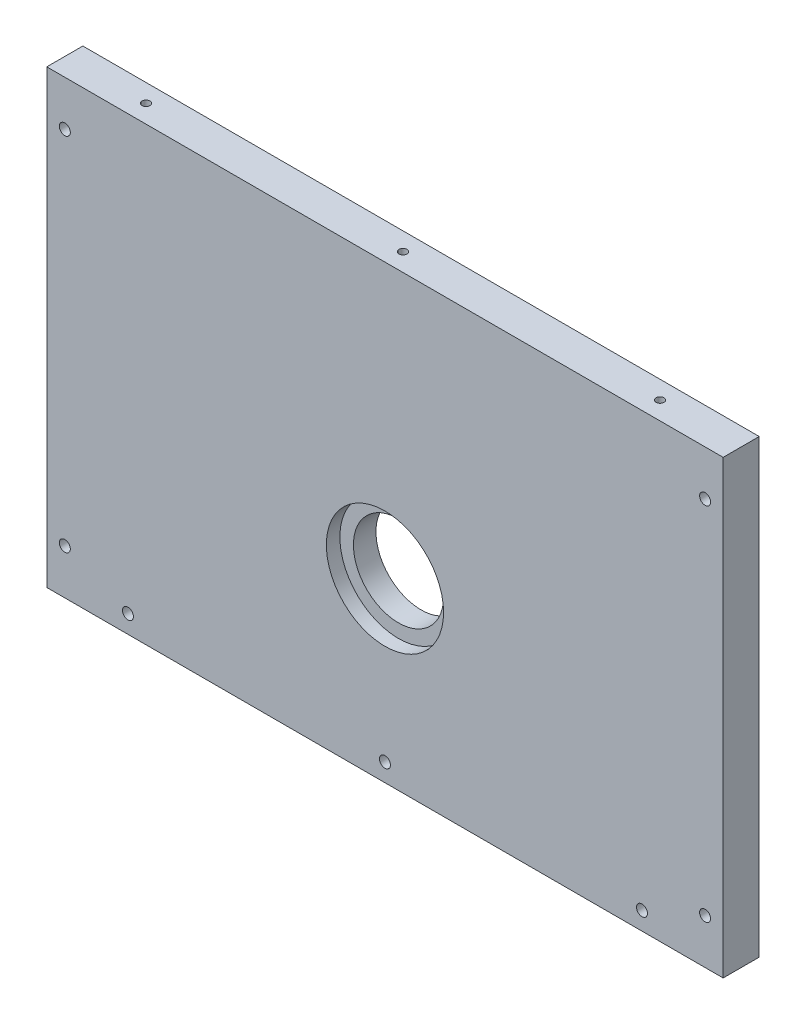
ISO-10303-21;
HEADER;
FILE_DESCRIPTION(('STEP AP214'),'2;1');
FILE_NAME('part.step','',(''),(''),'','','');
FILE_SCHEMA(('AUTOMOTIVE_DESIGN { 1 0 10303 214 1 1 1 1 }'));
ENDSEC;
DATA;
#1=APPLICATION_CONTEXT('core data for automotive mechanical design processes');
#2=APPLICATION_PROTOCOL_DEFINITION('international standard','automotive_design',2000,#1);
#3=PRODUCT_CONTEXT('',#1,'mechanical');
#4=PRODUCT('Part','Part','',(#3));
#5=PRODUCT_RELATED_PRODUCT_CATEGORY('part','',(#4));
#6=PRODUCT_DEFINITION_FORMATION('','',#4);
#7=PRODUCT_DEFINITION_CONTEXT('part definition',#1,'design');
#8=PRODUCT_DEFINITION('design','',#6,#7);
#9=PRODUCT_DEFINITION_SHAPE('','',#8);
#10=(LENGTH_UNIT() NAMED_UNIT(*) SI_UNIT(.MILLI.,.METRE.));
#11=(NAMED_UNIT(*) PLANE_ANGLE_UNIT() SI_UNIT($,.RADIAN.));
#12=(NAMED_UNIT(*) SI_UNIT($,.STERADIAN.) SOLID_ANGLE_UNIT());
#13=UNCERTAINTY_MEASURE_WITH_UNIT(LENGTH_MEASURE(1.E-05),#10,'distance_accuracy_value','');
#14=(GEOMETRIC_REPRESENTATION_CONTEXT(3) GLOBAL_UNCERTAINTY_ASSIGNED_CONTEXT((#13)) GLOBAL_UNIT_ASSIGNED_CONTEXT((#10,
#11,#12)) REPRESENTATION_CONTEXT('',''));
#15=CARTESIAN_POINT('',(0.,0.,0.));
#16=DIRECTION('',(0.,0.,1.));
#17=DIRECTION('',(1.,0.,0.));
#18=AXIS2_PLACEMENT_3D('',#15,#16,#17);
#19=CARTESIAN_POINT('',(75.,39.2,0.));
#20=DIRECTION('',(0.,0.,1.));
#21=DIRECTION('',(1.,0.,0.));
#22=AXIS2_PLACEMENT_3D('',#19,#20,#21);
#23=CYLINDRICAL_SURFACE('',#22,10.);
#24=CARTESIAN_POINT('',(75.,39.2,0.));
#25=DIRECTION('',(0.,0.,1.));
#26=DIRECTION('',(1.,0.,0.));
#27=AXIS2_PLACEMENT_3D('',#24,#25,#26);
#28=CIRCLE('',#27,10.);
#29=CARTESIAN_POINT('',(85.,39.2,0.));
#30=VERTEX_POINT('',#29);
#31=EDGE_CURVE('E131',#30,#30,#28,.T.);
#32=ORIENTED_EDGE('',*,*,#31,.F.);
#33=EDGE_LOOP('',(#32));
#34=FACE_BOUND('',#33,.T.);
#35=CARTESIAN_POINT('',(75.,39.2,5.));
#36=DIRECTION('',(0.,0.,1.));
#37=DIRECTION('',(1.,0.,0.));
#38=AXIS2_PLACEMENT_3D('',#35,#36,#37);
#39=CIRCLE('',#38,10.);
#40=CARTESIAN_POINT('',(85.,39.2,5.));
#41=VERTEX_POINT('',#40);
#42=EDGE_CURVE('E43',#41,#41,#39,.F.);
#43=ORIENTED_EDGE('',*,*,#42,.F.);
#44=EDGE_LOOP('',(#43));
#45=FACE_BOUND('',#44,.T.);
#46=ADVANCED_FACE('F39',(#34,#45),#23,.F.);
#47=CARTESIAN_POINT('',(0.,0.,8.));
#48=DIRECTION('',(1.,0.,0.));
#49=DIRECTION('',(0.,0.,-1.));
#50=AXIS2_PLACEMENT_3D('',#47,#48,#49);
#51=PLANE('',#50);
#52=DIRECTION('',(0.,-1.,0.));
#53=VECTOR('',#52,1.);
#54=CARTESIAN_POINT('',(0.,0.,0.));
#55=LINE('',#54,#53);
#56=CARTESIAN_POINT('',(0.,100.,0.));
#57=VERTEX_POINT('',#56);
#58=CARTESIAN_POINT('',(0.,0.,0.));
#59=VERTEX_POINT('',#58);
#60=EDGE_CURVE('E218',#57,#59,#55,.T.);
#61=ORIENTED_EDGE('',*,*,#60,.T.);
#62=DIRECTION('',(0.,0.,-1.));
#63=VECTOR('',#62,1.);
#64=CARTESIAN_POINT('',(0.,0.,8.));
#65=LINE('',#64,#63);
#66=CARTESIAN_POINT('',(0.,0.,8.));
#67=VERTEX_POINT('',#66);
#68=EDGE_CURVE('E11',#67,#59,#65,.T.);
#69=ORIENTED_EDGE('',*,*,#68,.F.);
#70=DIRECTION('',(0.,-1.,0.));
#71=VECTOR('',#70,1.);
#72=CARTESIAN_POINT('',(0.,0.,8.));
#73=LINE('',#72,#71);
#74=CARTESIAN_POINT('',(0.,100.,8.));
#75=VERTEX_POINT('',#74);
#76=EDGE_CURVE('E219',#75,#67,#73,.T.);
#77=ORIENTED_EDGE('',*,*,#76,.F.);
#78=DIRECTION('',(0.,0.,-1.));
#79=VECTOR('',#78,1.);
#80=CARTESIAN_POINT('',(0.,100.,8.));
#81=LINE('',#80,#79);
#82=EDGE_CURVE('E225',#75,#57,#81,.T.);
#83=ORIENTED_EDGE('',*,*,#82,.T.);
#84=EDGE_LOOP('',(#61,#69,#77,#83));
#85=FACE_BOUND('',#84,.T.);
#86=ADVANCED_FACE('F41',(#85),#51,.F.);
#87=CARTESIAN_POINT('',(0.,0.,8.));
#88=DIRECTION('',(0.,1.,0.));
#89=DIRECTION('',(0.,0.,1.));
#90=AXIS2_PLACEMENT_3D('',#87,#88,#89);
#91=PLANE('',#90);
#92=DIRECTION('',(1.,0.,0.));
#93=VECTOR('',#92,1.);
#94=CARTESIAN_POINT('',(0.,0.,0.));
#95=LINE('',#94,#93);
#96=CARTESIAN_POINT('',(150.,0.,0.));
#97=VERTEX_POINT('',#96);
#98=EDGE_CURVE('E228',#59,#97,#95,.T.);
#99=ORIENTED_EDGE('',*,*,#98,.T.);
#100=DIRECTION('',(0.,0.,-1.));
#101=VECTOR('',#100,1.);
#102=CARTESIAN_POINT('',(150.,0.,8.));
#103=LINE('',#102,#101);
#104=CARTESIAN_POINT('',(150.,0.,8.));
#105=VERTEX_POINT('',#104);
#106=EDGE_CURVE('E49',#105,#97,#103,.T.);
#107=ORIENTED_EDGE('',*,*,#106,.F.);
#108=DIRECTION('',(1.,0.,0.));
#109=VECTOR('',#108,1.);
#110=CARTESIAN_POINT('',(0.,0.,8.));
#111=LINE('',#110,#109);
#112=EDGE_CURVE('E88',#67,#105,#111,.T.);
#113=ORIENTED_EDGE('',*,*,#112,.F.);
#114=ORIENTED_EDGE('',*,*,#68,.T.);
#115=EDGE_LOOP('',(#99,#107,#113,#114));
#116=FACE_BOUND('',#115,.T.);
#117=ADVANCED_FACE('F254',(#116),#91,.F.);
#118=CARTESIAN_POINT('',(150.,0.,8.));
#119=DIRECTION('',(-1.,0.,0.));
#120=DIRECTION('',(0.,0.,1.));
#121=AXIS2_PLACEMENT_3D('',#118,#119,#120);
#122=PLANE('',#121);
#123=DIRECTION('',(0.,1.,0.));
#124=VECTOR('',#123,1.);
#125=CARTESIAN_POINT('',(150.,0.,0.));
#126=LINE('',#125,#124);
#127=CARTESIAN_POINT('',(150.,100.,0.));
#128=VERTEX_POINT('',#127);
#129=EDGE_CURVE('E75',#97,#128,#126,.T.);
#130=ORIENTED_EDGE('',*,*,#129,.T.);
#131=DIRECTION('',(0.,0.,-1.));
#132=VECTOR('',#131,1.);
#133=CARTESIAN_POINT('',(150.,100.,8.));
#134=LINE('',#133,#132);
#135=CARTESIAN_POINT('',(150.,100.,8.));
#136=VERTEX_POINT('',#135);
#137=EDGE_CURVE('E233',#136,#128,#134,.T.);
#138=ORIENTED_EDGE('',*,*,#137,.F.);
#139=DIRECTION('',(0.,1.,0.));
#140=VECTOR('',#139,1.);
#141=CARTESIAN_POINT('',(150.,0.,8.));
#142=LINE('',#141,#140);
#143=EDGE_CURVE('E222',#105,#136,#142,.T.);
#144=ORIENTED_EDGE('',*,*,#143,.F.);
#145=ORIENTED_EDGE('',*,*,#106,.T.);
#146=EDGE_LOOP('',(#130,#138,#144,#145));
#147=FACE_BOUND('',#146,.T.);
#148=ADVANCED_FACE('F236',(#147),#122,.F.);
#149=CARTESIAN_POINT('',(0.,100.,8.));
#150=DIRECTION('',(0.,-1.,0.));
#151=DIRECTION('',(0.,0.,-1.));
#152=AXIS2_PLACEMENT_3D('',#149,#150,#151);
#153=PLANE('',#152);
#154=CARTESIAN_POINT('',(18.,100.,4.));
#155=DIRECTION('',(0.,1.,0.));
#156=DIRECTION('',(0.,0.,1.));
#157=AXIS2_PLACEMENT_3D('',#154,#155,#156);
#158=CIRCLE('',#157,0.888999999999997);
#159=CARTESIAN_POINT('',(18.,100.,4.889));
#160=VERTEX_POINT('',#159);
#161=EDGE_CURVE('E109',#160,#160,#158,.T.);
#162=ORIENTED_EDGE('',*,*,#161,.F.);
#163=EDGE_LOOP('',(#162));
#164=FACE_BOUND('',#163,.T.);
#165=CARTESIAN_POINT('',(75.,100.,3.99999999999999));
#166=DIRECTION('',(0.,1.,0.));
#167=DIRECTION('',(0.,0.,1.));
#168=AXIS2_PLACEMENT_3D('',#165,#166,#167);
#169=CIRCLE('',#168,0.889000000000001);
#170=CARTESIAN_POINT('',(75.,100.,4.88899999999999));
#171=VERTEX_POINT('',#170);
#172=EDGE_CURVE('E108',#171,#171,#169,.T.);
#173=ORIENTED_EDGE('',*,*,#172,.F.);
#174=EDGE_LOOP('',(#173));
#175=FACE_BOUND('',#174,.T.);
#176=CARTESIAN_POINT('',(132.,100.,3.99999999999999));
#177=DIRECTION('',(0.,1.,0.));
#178=DIRECTION('',(0.,0.,1.));
#179=AXIS2_PLACEMENT_3D('',#176,#177,#178);
#180=CIRCLE('',#179,0.889000000000001);
#181=CARTESIAN_POINT('',(132.,100.,4.88899999999999));
#182=VERTEX_POINT('',#181);
#183=EDGE_CURVE('E119',#182,#182,#180,.T.);
#184=ORIENTED_EDGE('',*,*,#183,.F.);
#185=EDGE_LOOP('',(#184));
#186=FACE_BOUND('',#185,.T.);
#187=DIRECTION('',(-1.,0.,0.));
#188=VECTOR('',#187,1.);
#189=CARTESIAN_POINT('',(0.,100.,0.));
#190=LINE('',#189,#188);
#191=EDGE_CURVE('E81',#128,#57,#190,.T.);
#192=ORIENTED_EDGE('',*,*,#191,.T.);
#193=ORIENTED_EDGE('',*,*,#82,.F.);
#194=DIRECTION('',(-1.,0.,0.));
#195=VECTOR('',#194,1.);
#196=CARTESIAN_POINT('',(0.,100.,8.));
#197=LINE('',#196,#195);
#198=EDGE_CURVE('E57',#136,#75,#197,.T.);
#199=ORIENTED_EDGE('',*,*,#198,.F.);
#200=ORIENTED_EDGE('',*,*,#137,.T.);
#201=EDGE_LOOP('',(#192,#193,#199,#200));
#202=FACE_BOUND('',#201,.T.);
#203=ADVANCED_FACE('F243',(#164,#175,#186,#202),#153,.F.);
#204=CARTESIAN_POINT('',(0.,0.,8.));
#205=DIRECTION('',(0.,0.,-1.));
#206=DIRECTION('',(-1.,0.,0.));
#207=AXIS2_PLACEMENT_3D('',#204,#205,#206);
#208=PLANE('',#207);
#209=CARTESIAN_POINT('',(75.,39.2,8.));
#210=DIRECTION('',(0.,0.,1.));
#211=DIRECTION('',(1.,0.,0.));
#212=AXIS2_PLACEMENT_3D('',#209,#210,#211);
#213=CIRCLE('',#212,13.);
#214=CARTESIAN_POINT('',(88.,39.2,8.));
#215=VERTEX_POINT('',#214);
#216=EDGE_CURVE('E125',#215,#215,#213,.T.);
#217=ORIENTED_EDGE('',*,*,#216,.F.);
#218=EDGE_LOOP('',(#217));
#219=FACE_BOUND('',#218,.T.);
#220=CARTESIAN_POINT('',(132.,3.99999999999998,8.));
#221=DIRECTION('',(0.,0.,-1.));
#222=DIRECTION('',(-1.,0.,0.));
#223=AXIS2_PLACEMENT_3D('',#220,#221,#222);
#224=CIRCLE('',#223,1.2192);
#225=CARTESIAN_POINT('',(130.7808,3.99999999999998,8.));
#226=VERTEX_POINT('',#225);
#227=EDGE_CURVE('E143',#226,#226,#224,.T.);
#228=ORIENTED_EDGE('',*,*,#227,.T.);
#229=EDGE_LOOP('',(#228));
#230=FACE_BOUND('',#229,.T.);
#231=CARTESIAN_POINT('',(18.,4.,8.));
#232=DIRECTION('',(0.,0.,-1.));
#233=DIRECTION('',(-1.,0.,0.));
#234=AXIS2_PLACEMENT_3D('',#231,#232,#233);
#235=CIRCLE('',#234,1.2192);
#236=CARTESIAN_POINT('',(16.7808,4.,8.));
#237=VERTEX_POINT('',#236);
#238=EDGE_CURVE('E155',#237,#237,#235,.T.);
#239=ORIENTED_EDGE('',*,*,#238,.T.);
#240=EDGE_LOOP('',(#239));
#241=FACE_BOUND('',#240,.T.);
#242=CARTESIAN_POINT('',(146.,90.,8.));
#243=DIRECTION('',(0.,0.,-1.));
#244=DIRECTION('',(-1.,0.,0.));
#245=AXIS2_PLACEMENT_3D('',#242,#243,#244);
#246=CIRCLE('',#245,1.2192);
#247=CARTESIAN_POINT('',(144.7808,90.,8.));
#248=VERTEX_POINT('',#247);
#249=EDGE_CURVE('E167',#248,#248,#246,.T.);
#250=ORIENTED_EDGE('',*,*,#249,.T.);
#251=EDGE_LOOP('',(#250));
#252=FACE_BOUND('',#251,.T.);
#253=CARTESIAN_POINT('',(4.,90.,8.));
#254=DIRECTION('',(0.,0.,-1.));
#255=DIRECTION('',(-1.,0.,0.));
#256=AXIS2_PLACEMENT_3D('',#253,#254,#255);
#257=CIRCLE('',#256,1.2192);
#258=CARTESIAN_POINT('',(2.7808,90.,8.));
#259=VERTEX_POINT('',#258);
#260=EDGE_CURVE('E179',#259,#259,#257,.T.);
#261=ORIENTED_EDGE('',*,*,#260,.T.);
#262=EDGE_LOOP('',(#261));
#263=FACE_BOUND('',#262,.T.);
#264=CARTESIAN_POINT('',(146.,9.99999999999997,8.));
#265=DIRECTION('',(0.,0.,-1.));
#266=DIRECTION('',(-1.,0.,0.));
#267=AXIS2_PLACEMENT_3D('',#264,#265,#266);
#268=CIRCLE('',#267,1.2192);
#269=CARTESIAN_POINT('',(144.7808,9.99999999999997,8.));
#270=VERTEX_POINT('',#269);
#271=EDGE_CURVE('E191',#270,#270,#268,.T.);
#272=ORIENTED_EDGE('',*,*,#271,.T.);
#273=EDGE_LOOP('',(#272));
#274=FACE_BOUND('',#273,.T.);
#275=CARTESIAN_POINT('',(4.,10.,8.));
#276=DIRECTION('',(0.,0.,-1.));
#277=DIRECTION('',(-1.,0.,0.));
#278=AXIS2_PLACEMENT_3D('',#275,#276,#277);
#279=CIRCLE('',#278,1.2192);
#280=CARTESIAN_POINT('',(2.7808,10.,8.));
#281=VERTEX_POINT('',#280);
#282=EDGE_CURVE('E203',#281,#281,#279,.T.);
#283=ORIENTED_EDGE('',*,*,#282,.T.);
#284=EDGE_LOOP('',(#283));
#285=FACE_BOUND('',#284,.T.);
#286=CARTESIAN_POINT('',(75.,3.99999999999999,8.));
#287=DIRECTION('',(0.,0.,-1.));
#288=DIRECTION('',(-1.,0.,0.));
#289=AXIS2_PLACEMENT_3D('',#286,#287,#288);
#290=CIRCLE('',#289,1.2192);
#291=CARTESIAN_POINT('',(73.7808,3.99999999999999,8.));
#292=VERTEX_POINT('',#291);
#293=EDGE_CURVE('E215',#292,#292,#290,.T.);
#294=ORIENTED_EDGE('',*,*,#293,.T.);
#295=EDGE_LOOP('',(#294));
#296=FACE_BOUND('',#295,.T.);
#297=ORIENTED_EDGE('',*,*,#76,.T.);
#298=ORIENTED_EDGE('',*,*,#112,.T.);
#299=ORIENTED_EDGE('',*,*,#143,.T.);
#300=ORIENTED_EDGE('',*,*,#198,.T.);
#301=EDGE_LOOP('',(#297,#298,#299,#300));
#302=FACE_BOUND('',#301,.T.);
#303=ADVANCED_FACE('F245',(#219,#230,#241,#252,#263,#274,#285,#296,#302),#208,.F.);
#304=CARTESIAN_POINT('',(0.,0.,0.));
#305=DIRECTION('',(0.,0.,-1.));
#306=DIRECTION('',(-1.,0.,0.));
#307=AXIS2_PLACEMENT_3D('',#304,#305,#306);
#308=PLANE('',#307);
#309=ORIENTED_EDGE('',*,*,#31,.T.);
#310=EDGE_LOOP('',(#309));
#311=FACE_BOUND('',#310,.T.);
#312=CARTESIAN_POINT('',(132.,3.99999999999998,0.));
#313=DIRECTION('',(0.,0.,-1.));
#314=DIRECTION('',(-1.,0.,0.));
#315=AXIS2_PLACEMENT_3D('',#312,#313,#314);
#316=CIRCLE('',#315,2.38125);
#317=CARTESIAN_POINT('',(129.61875,3.99999999999998,0.));
#318=VERTEX_POINT('',#317);
#319=EDGE_CURVE('E134',#318,#318,#316,.T.);
#320=ORIENTED_EDGE('',*,*,#319,.F.);
#321=EDGE_LOOP('',(#320));
#322=FACE_BOUND('',#321,.T.);
#323=CARTESIAN_POINT('',(18.,4.,0.));
#324=DIRECTION('',(0.,0.,-1.));
#325=DIRECTION('',(-1.,0.,0.));
#326=AXIS2_PLACEMENT_3D('',#323,#324,#325);
#327=CIRCLE('',#326,2.38125);
#328=CARTESIAN_POINT('',(15.61875,4.,0.));
#329=VERTEX_POINT('',#328);
#330=EDGE_CURVE('E146',#329,#329,#327,.T.);
#331=ORIENTED_EDGE('',*,*,#330,.F.);
#332=EDGE_LOOP('',(#331));
#333=FACE_BOUND('',#332,.T.);
#334=CARTESIAN_POINT('',(146.,90.,0.));
#335=DIRECTION('',(0.,0.,-1.));
#336=DIRECTION('',(-1.,0.,0.));
#337=AXIS2_PLACEMENT_3D('',#334,#335,#336);
#338=CIRCLE('',#337,2.38125);
#339=CARTESIAN_POINT('',(143.61875,90.,0.));
#340=VERTEX_POINT('',#339);
#341=EDGE_CURVE('E158',#340,#340,#338,.T.);
#342=ORIENTED_EDGE('',*,*,#341,.F.);
#343=EDGE_LOOP('',(#342));
#344=FACE_BOUND('',#343,.T.);
#345=CARTESIAN_POINT('',(4.,90.,0.));
#346=DIRECTION('',(0.,0.,-1.));
#347=DIRECTION('',(-1.,0.,0.));
#348=AXIS2_PLACEMENT_3D('',#345,#346,#347);
#349=CIRCLE('',#348,2.38125);
#350=CARTESIAN_POINT('',(1.61875,90.,0.));
#351=VERTEX_POINT('',#350);
#352=EDGE_CURVE('E170',#351,#351,#349,.T.);
#353=ORIENTED_EDGE('',*,*,#352,.F.);
#354=EDGE_LOOP('',(#353));
#355=FACE_BOUND('',#354,.T.);
#356=CARTESIAN_POINT('',(146.,9.99999999999997,0.));
#357=DIRECTION('',(0.,0.,-1.));
#358=DIRECTION('',(-1.,0.,0.));
#359=AXIS2_PLACEMENT_3D('',#356,#357,#358);
#360=CIRCLE('',#359,2.38125);
#361=CARTESIAN_POINT('',(143.61875,9.99999999999997,0.));
#362=VERTEX_POINT('',#361);
#363=EDGE_CURVE('E182',#362,#362,#360,.T.);
#364=ORIENTED_EDGE('',*,*,#363,.F.);
#365=EDGE_LOOP('',(#364));
#366=FACE_BOUND('',#365,.T.);
#367=CARTESIAN_POINT('',(4.,10.,0.));
#368=DIRECTION('',(0.,0.,-1.));
#369=DIRECTION('',(-1.,0.,0.));
#370=AXIS2_PLACEMENT_3D('',#367,#368,#369);
#371=CIRCLE('',#370,2.38125);
#372=CARTESIAN_POINT('',(1.61875,10.,0.));
#373=VERTEX_POINT('',#372);
#374=EDGE_CURVE('E194',#373,#373,#371,.T.);
#375=ORIENTED_EDGE('',*,*,#374,.F.);
#376=EDGE_LOOP('',(#375));
#377=FACE_BOUND('',#376,.T.);
#378=CARTESIAN_POINT('',(75.,3.99999999999999,0.));
#379=DIRECTION('',(0.,0.,-1.));
#380=DIRECTION('',(-1.,0.,0.));
#381=AXIS2_PLACEMENT_3D('',#378,#379,#380);
#382=CIRCLE('',#381,2.38125);
#383=CARTESIAN_POINT('',(72.61875,3.99999999999999,0.));
#384=VERTEX_POINT('',#383);
#385=EDGE_CURVE('E206',#384,#384,#382,.T.);
#386=ORIENTED_EDGE('',*,*,#385,.F.);
#387=EDGE_LOOP('',(#386));
#388=FACE_BOUND('',#387,.T.);
#389=ORIENTED_EDGE('',*,*,#60,.F.);
#390=ORIENTED_EDGE('',*,*,#191,.F.);
#391=ORIENTED_EDGE('',*,*,#129,.F.);
#392=ORIENTED_EDGE('',*,*,#98,.F.);
#393=EDGE_LOOP('',(#389,#390,#391,#392));
#394=FACE_BOUND('',#393,.T.);
#395=ADVANCED_FACE('F239',(#311,#322,#333,#344,#355,#366,#377,#388,#394),#308,.T.);
#396=CARTESIAN_POINT('',(75.,3.99999999999999,0.));
#397=DIRECTION('',(0.,0.,-1.));
#398=DIRECTION('',(-1.,0.,0.));
#399=AXIS2_PLACEMENT_3D('',#396,#397,#398);
#400=CYLINDRICAL_SURFACE('',#399,1.2192);
#401=ORIENTED_EDGE('',*,*,#293,.F.);
#402=EDGE_LOOP('',(#401));
#403=FACE_BOUND('',#402,.T.);
#404=CARTESIAN_POINT('',(75.,3.99999999999999,2.1844));
#405=DIRECTION('',(0.,0.,-1.));
#406=DIRECTION('',(-1.,0.,0.));
#407=AXIS2_PLACEMENT_3D('',#404,#405,#406);
#408=CIRCLE('',#407,1.2192);
#409=CARTESIAN_POINT('',(73.7808,3.99999999999999,2.1844));
#410=VERTEX_POINT('',#409);
#411=EDGE_CURVE('E212',#410,#410,#408,.T.);
#412=ORIENTED_EDGE('',*,*,#411,.T.);
#413=EDGE_LOOP('',(#412));
#414=FACE_BOUND('',#413,.T.);
#415=ADVANCED_FACE('F351',(#403,#414),#400,.F.);
#416=CARTESIAN_POINT('',(76.2192,3.99999999999999,2.1844));
#417=DIRECTION('',(0.,0.,1.));
#418=DIRECTION('',(1.,0.,0.));
#419=AXIS2_PLACEMENT_3D('',#416,#417,#418);
#420=PLANE('',#419);
#421=ORIENTED_EDGE('',*,*,#411,.F.);
#422=EDGE_LOOP('',(#421));
#423=FACE_BOUND('',#422,.T.);
#424=CARTESIAN_POINT('',(75.,3.99999999999999,2.1844));
#425=DIRECTION('',(0.,0.,-1.));
#426=DIRECTION('',(-1.,0.,0.));
#427=AXIS2_PLACEMENT_3D('',#424,#425,#426);
#428=CIRCLE('',#427,2.38125);
#429=CARTESIAN_POINT('',(72.61875,3.99999999999999,2.1844));
#430=VERTEX_POINT('',#429);
#431=EDGE_CURVE('E209',#430,#430,#428,.T.);
#432=ORIENTED_EDGE('',*,*,#431,.T.);
#433=EDGE_LOOP('',(#432));
#434=FACE_BOUND('',#433,.T.);
#435=ADVANCED_FACE('F347',(#423,#434),#420,.F.);
#436=CARTESIAN_POINT('',(75.,3.99999999999999,0.));
#437=DIRECTION('',(0.,0.,-1.));
#438=DIRECTION('',(-1.,0.,0.));
#439=AXIS2_PLACEMENT_3D('',#436,#437,#438);
#440=CYLINDRICAL_SURFACE('',#439,2.38125);
#441=ORIENTED_EDGE('',*,*,#431,.F.);
#442=EDGE_LOOP('',(#441));
#443=FACE_BOUND('',#442,.T.);
#444=ORIENTED_EDGE('',*,*,#385,.T.);
#445=EDGE_LOOP('',(#444));
#446=FACE_BOUND('',#445,.T.);
#447=ADVANCED_FACE('F343',(#443,#446),#440,.F.);
#448=CARTESIAN_POINT('',(4.,10.,0.));
#449=DIRECTION('',(0.,0.,-1.));
#450=DIRECTION('',(-1.,0.,0.));
#451=AXIS2_PLACEMENT_3D('',#448,#449,#450);
#452=CYLINDRICAL_SURFACE('',#451,1.2192);
#453=ORIENTED_EDGE('',*,*,#282,.F.);
#454=EDGE_LOOP('',(#453));
#455=FACE_BOUND('',#454,.T.);
#456=CARTESIAN_POINT('',(4.,10.,2.1844));
#457=DIRECTION('',(0.,0.,-1.));
#458=DIRECTION('',(-1.,0.,0.));
#459=AXIS2_PLACEMENT_3D('',#456,#457,#458);
#460=CIRCLE('',#459,1.2192);
#461=CARTESIAN_POINT('',(2.7808,10.,2.1844));
#462=VERTEX_POINT('',#461);
#463=EDGE_CURVE('E200',#462,#462,#460,.T.);
#464=ORIENTED_EDGE('',*,*,#463,.T.);
#465=EDGE_LOOP('',(#464));
#466=FACE_BOUND('',#465,.T.);
#467=ADVANCED_FACE('F339',(#455,#466),#452,.F.);
#468=CARTESIAN_POINT('',(5.2192,10.,2.1844));
#469=DIRECTION('',(0.,0.,1.));
#470=DIRECTION('',(1.,0.,0.));
#471=AXIS2_PLACEMENT_3D('',#468,#469,#470);
#472=PLANE('',#471);
#473=ORIENTED_EDGE('',*,*,#463,.F.);
#474=EDGE_LOOP('',(#473));
#475=FACE_BOUND('',#474,.T.);
#476=CARTESIAN_POINT('',(4.,10.,2.1844));
#477=DIRECTION('',(0.,0.,-1.));
#478=DIRECTION('',(-1.,0.,0.));
#479=AXIS2_PLACEMENT_3D('',#476,#477,#478);
#480=CIRCLE('',#479,2.38125);
#481=CARTESIAN_POINT('',(1.61875,10.,2.1844));
#482=VERTEX_POINT('',#481);
#483=EDGE_CURVE('E197',#482,#482,#480,.T.);
#484=ORIENTED_EDGE('',*,*,#483,.T.);
#485=EDGE_LOOP('',(#484));
#486=FACE_BOUND('',#485,.T.);
#487=ADVANCED_FACE('F335',(#475,#486),#472,.F.);
#488=CARTESIAN_POINT('',(4.,10.,0.));
#489=DIRECTION('',(0.,0.,-1.));
#490=DIRECTION('',(-1.,0.,0.));
#491=AXIS2_PLACEMENT_3D('',#488,#489,#490);
#492=CYLINDRICAL_SURFACE('',#491,2.38125);
#493=ORIENTED_EDGE('',*,*,#483,.F.);
#494=EDGE_LOOP('',(#493));
#495=FACE_BOUND('',#494,.T.);
#496=ORIENTED_EDGE('',*,*,#374,.T.);
#497=EDGE_LOOP('',(#496));
#498=FACE_BOUND('',#497,.T.);
#499=ADVANCED_FACE('F331',(#495,#498),#492,.F.);
#500=CARTESIAN_POINT('',(146.,9.99999999999997,0.));
#501=DIRECTION('',(0.,0.,-1.));
#502=DIRECTION('',(-1.,0.,0.));
#503=AXIS2_PLACEMENT_3D('',#500,#501,#502);
#504=CYLINDRICAL_SURFACE('',#503,1.2192);
#505=ORIENTED_EDGE('',*,*,#271,.F.);
#506=EDGE_LOOP('',(#505));
#507=FACE_BOUND('',#506,.T.);
#508=CARTESIAN_POINT('',(146.,9.99999999999997,2.1844));
#509=DIRECTION('',(0.,0.,-1.));
#510=DIRECTION('',(-1.,0.,0.));
#511=AXIS2_PLACEMENT_3D('',#508,#509,#510);
#512=CIRCLE('',#511,1.2192);
#513=CARTESIAN_POINT('',(144.7808,9.99999999999997,2.1844));
#514=VERTEX_POINT('',#513);
#515=EDGE_CURVE('E188',#514,#514,#512,.T.);
#516=ORIENTED_EDGE('',*,*,#515,.T.);
#517=EDGE_LOOP('',(#516));
#518=FACE_BOUND('',#517,.T.);
#519=ADVANCED_FACE('F327',(#507,#518),#504,.F.);
#520=CARTESIAN_POINT('',(147.2192,9.99999999999997,2.1844));
#521=DIRECTION('',(0.,0.,1.));
#522=DIRECTION('',(1.,0.,0.));
#523=AXIS2_PLACEMENT_3D('',#520,#521,#522);
#524=PLANE('',#523);
#525=ORIENTED_EDGE('',*,*,#515,.F.);
#526=EDGE_LOOP('',(#525));
#527=FACE_BOUND('',#526,.T.);
#528=CARTESIAN_POINT('',(146.,9.99999999999997,2.1844));
#529=DIRECTION('',(0.,0.,-1.));
#530=DIRECTION('',(-1.,0.,0.));
#531=AXIS2_PLACEMENT_3D('',#528,#529,#530);
#532=CIRCLE('',#531,2.38125);
#533=CARTESIAN_POINT('',(143.61875,9.99999999999997,2.1844));
#534=VERTEX_POINT('',#533);
#535=EDGE_CURVE('E185',#534,#534,#532,.T.);
#536=ORIENTED_EDGE('',*,*,#535,.T.);
#537=EDGE_LOOP('',(#536));
#538=FACE_BOUND('',#537,.T.);
#539=ADVANCED_FACE('F323',(#527,#538),#524,.F.);
#540=CARTESIAN_POINT('',(146.,9.99999999999997,0.));
#541=DIRECTION('',(0.,0.,-1.));
#542=DIRECTION('',(-1.,0.,0.));
#543=AXIS2_PLACEMENT_3D('',#540,#541,#542);
#544=CYLINDRICAL_SURFACE('',#543,2.38125);
#545=ORIENTED_EDGE('',*,*,#535,.F.);
#546=EDGE_LOOP('',(#545));
#547=FACE_BOUND('',#546,.T.);
#548=ORIENTED_EDGE('',*,*,#363,.T.);
#549=EDGE_LOOP('',(#548));
#550=FACE_BOUND('',#549,.T.);
#551=ADVANCED_FACE('F319',(#547,#550),#544,.F.);
#552=CARTESIAN_POINT('',(4.,90.,0.));
#553=DIRECTION('',(0.,0.,-1.));
#554=DIRECTION('',(-1.,0.,0.));
#555=AXIS2_PLACEMENT_3D('',#552,#553,#554);
#556=CYLINDRICAL_SURFACE('',#555,1.2192);
#557=ORIENTED_EDGE('',*,*,#260,.F.);
#558=EDGE_LOOP('',(#557));
#559=FACE_BOUND('',#558,.T.);
#560=CARTESIAN_POINT('',(4.,90.,2.1844));
#561=DIRECTION('',(0.,0.,-1.));
#562=DIRECTION('',(-1.,0.,0.));
#563=AXIS2_PLACEMENT_3D('',#560,#561,#562);
#564=CIRCLE('',#563,1.2192);
#565=CARTESIAN_POINT('',(2.7808,90.,2.1844));
#566=VERTEX_POINT('',#565);
#567=EDGE_CURVE('E176',#566,#566,#564,.T.);
#568=ORIENTED_EDGE('',*,*,#567,.T.);
#569=EDGE_LOOP('',(#568));
#570=FACE_BOUND('',#569,.T.);
#571=ADVANCED_FACE('F315',(#559,#570),#556,.F.);
#572=CARTESIAN_POINT('',(5.2192,90.,2.1844));
#573=DIRECTION('',(0.,0.,1.));
#574=DIRECTION('',(1.,0.,0.));
#575=AXIS2_PLACEMENT_3D('',#572,#573,#574);
#576=PLANE('',#575);
#577=ORIENTED_EDGE('',*,*,#567,.F.);
#578=EDGE_LOOP('',(#577));
#579=FACE_BOUND('',#578,.T.);
#580=CARTESIAN_POINT('',(4.,90.,2.1844));
#581=DIRECTION('',(0.,0.,-1.));
#582=DIRECTION('',(-1.,0.,0.));
#583=AXIS2_PLACEMENT_3D('',#580,#581,#582);
#584=CIRCLE('',#583,2.38125);
#585=CARTESIAN_POINT('',(1.61875,90.,2.1844));
#586=VERTEX_POINT('',#585);
#587=EDGE_CURVE('E173',#586,#586,#584,.T.);
#588=ORIENTED_EDGE('',*,*,#587,.T.);
#589=EDGE_LOOP('',(#588));
#590=FACE_BOUND('',#589,.T.);
#591=ADVANCED_FACE('F311',(#579,#590),#576,.F.);
#592=CARTESIAN_POINT('',(4.,90.,0.));
#593=DIRECTION('',(0.,0.,-1.));
#594=DIRECTION('',(-1.,0.,0.));
#595=AXIS2_PLACEMENT_3D('',#592,#593,#594);
#596=CYLINDRICAL_SURFACE('',#595,2.38125);
#597=ORIENTED_EDGE('',*,*,#587,.F.);
#598=EDGE_LOOP('',(#597));
#599=FACE_BOUND('',#598,.T.);
#600=ORIENTED_EDGE('',*,*,#352,.T.);
#601=EDGE_LOOP('',(#600));
#602=FACE_BOUND('',#601,.T.);
#603=ADVANCED_FACE('F307',(#599,#602),#596,.F.);
#604=CARTESIAN_POINT('',(146.,90.,0.));
#605=DIRECTION('',(0.,0.,-1.));
#606=DIRECTION('',(-1.,0.,0.));
#607=AXIS2_PLACEMENT_3D('',#604,#605,#606);
#608=CYLINDRICAL_SURFACE('',#607,1.2192);
#609=ORIENTED_EDGE('',*,*,#249,.F.);
#610=EDGE_LOOP('',(#609));
#611=FACE_BOUND('',#610,.T.);
#612=CARTESIAN_POINT('',(146.,90.,2.1844));
#613=DIRECTION('',(0.,0.,-1.));
#614=DIRECTION('',(-1.,0.,0.));
#615=AXIS2_PLACEMENT_3D('',#612,#613,#614);
#616=CIRCLE('',#615,1.2192);
#617=CARTESIAN_POINT('',(144.7808,90.,2.1844));
#618=VERTEX_POINT('',#617);
#619=EDGE_CURVE('E164',#618,#618,#616,.T.);
#620=ORIENTED_EDGE('',*,*,#619,.T.);
#621=EDGE_LOOP('',(#620));
#622=FACE_BOUND('',#621,.T.);
#623=ADVANCED_FACE('F303',(#611,#622),#608,.F.);
#624=CARTESIAN_POINT('',(147.2192,90.,2.1844));
#625=DIRECTION('',(0.,0.,1.));
#626=DIRECTION('',(1.,0.,0.));
#627=AXIS2_PLACEMENT_3D('',#624,#625,#626);
#628=PLANE('',#627);
#629=ORIENTED_EDGE('',*,*,#619,.F.);
#630=EDGE_LOOP('',(#629));
#631=FACE_BOUND('',#630,.T.);
#632=CARTESIAN_POINT('',(146.,90.,2.1844));
#633=DIRECTION('',(0.,0.,-1.));
#634=DIRECTION('',(-1.,0.,0.));
#635=AXIS2_PLACEMENT_3D('',#632,#633,#634);
#636=CIRCLE('',#635,2.38125);
#637=CARTESIAN_POINT('',(143.61875,90.,2.1844));
#638=VERTEX_POINT('',#637);
#639=EDGE_CURVE('E161',#638,#638,#636,.T.);
#640=ORIENTED_EDGE('',*,*,#639,.T.);
#641=EDGE_LOOP('',(#640));
#642=FACE_BOUND('',#641,.T.);
#643=ADVANCED_FACE('F299',(#631,#642),#628,.F.);
#644=CARTESIAN_POINT('',(146.,90.,0.));
#645=DIRECTION('',(0.,0.,-1.));
#646=DIRECTION('',(-1.,0.,0.));
#647=AXIS2_PLACEMENT_3D('',#644,#645,#646);
#648=CYLINDRICAL_SURFACE('',#647,2.38125);
#649=ORIENTED_EDGE('',*,*,#639,.F.);
#650=EDGE_LOOP('',(#649));
#651=FACE_BOUND('',#650,.T.);
#652=ORIENTED_EDGE('',*,*,#341,.T.);
#653=EDGE_LOOP('',(#652));
#654=FACE_BOUND('',#653,.T.);
#655=ADVANCED_FACE('F295',(#651,#654),#648,.F.);
#656=CARTESIAN_POINT('',(18.,4.,0.));
#657=DIRECTION('',(0.,0.,-1.));
#658=DIRECTION('',(-1.,0.,0.));
#659=AXIS2_PLACEMENT_3D('',#656,#657,#658);
#660=CYLINDRICAL_SURFACE('',#659,1.2192);
#661=ORIENTED_EDGE('',*,*,#238,.F.);
#662=EDGE_LOOP('',(#661));
#663=FACE_BOUND('',#662,.T.);
#664=CARTESIAN_POINT('',(18.,4.,2.1844));
#665=DIRECTION('',(0.,0.,-1.));
#666=DIRECTION('',(-1.,0.,0.));
#667=AXIS2_PLACEMENT_3D('',#664,#665,#666);
#668=CIRCLE('',#667,1.2192);
#669=CARTESIAN_POINT('',(16.7808,4.,2.1844));
#670=VERTEX_POINT('',#669);
#671=EDGE_CURVE('E152',#670,#670,#668,.T.);
#672=ORIENTED_EDGE('',*,*,#671,.T.);
#673=EDGE_LOOP('',(#672));
#674=FACE_BOUND('',#673,.T.);
#675=ADVANCED_FACE('F291',(#663,#674),#660,.F.);
#676=CARTESIAN_POINT('',(19.2192,4.,2.1844));
#677=DIRECTION('',(0.,0.,1.));
#678=DIRECTION('',(1.,0.,0.));
#679=AXIS2_PLACEMENT_3D('',#676,#677,#678);
#680=PLANE('',#679);
#681=ORIENTED_EDGE('',*,*,#671,.F.);
#682=EDGE_LOOP('',(#681));
#683=FACE_BOUND('',#682,.T.);
#684=CARTESIAN_POINT('',(18.,4.,2.1844));
#685=DIRECTION('',(0.,0.,-1.));
#686=DIRECTION('',(-1.,0.,0.));
#687=AXIS2_PLACEMENT_3D('',#684,#685,#686);
#688=CIRCLE('',#687,2.38125);
#689=CARTESIAN_POINT('',(15.61875,4.,2.1844));
#690=VERTEX_POINT('',#689);
#691=EDGE_CURVE('E149',#690,#690,#688,.T.);
#692=ORIENTED_EDGE('',*,*,#691,.T.);
#693=EDGE_LOOP('',(#692));
#694=FACE_BOUND('',#693,.T.);
#695=ADVANCED_FACE('F287',(#683,#694),#680,.F.);
#696=CARTESIAN_POINT('',(18.,4.,0.));
#697=DIRECTION('',(0.,0.,-1.));
#698=DIRECTION('',(-1.,0.,0.));
#699=AXIS2_PLACEMENT_3D('',#696,#697,#698);
#700=CYLINDRICAL_SURFACE('',#699,2.38125);
#701=ORIENTED_EDGE('',*,*,#691,.F.);
#702=EDGE_LOOP('',(#701));
#703=FACE_BOUND('',#702,.T.);
#704=ORIENTED_EDGE('',*,*,#330,.T.);
#705=EDGE_LOOP('',(#704));
#706=FACE_BOUND('',#705,.T.);
#707=ADVANCED_FACE('F283',(#703,#706),#700,.F.);
#708=CARTESIAN_POINT('',(132.,3.99999999999998,0.));
#709=DIRECTION('',(0.,0.,-1.));
#710=DIRECTION('',(-1.,0.,0.));
#711=AXIS2_PLACEMENT_3D('',#708,#709,#710);
#712=CYLINDRICAL_SURFACE('',#711,1.2192);
#713=ORIENTED_EDGE('',*,*,#227,.F.);
#714=EDGE_LOOP('',(#713));
#715=FACE_BOUND('',#714,.T.);
#716=CARTESIAN_POINT('',(132.,3.99999999999998,2.1844));
#717=DIRECTION('',(0.,0.,-1.));
#718=DIRECTION('',(-1.,0.,0.));
#719=AXIS2_PLACEMENT_3D('',#716,#717,#718);
#720=CIRCLE('',#719,1.2192);
#721=CARTESIAN_POINT('',(130.7808,3.99999999999998,2.1844));
#722=VERTEX_POINT('',#721);
#723=EDGE_CURVE('E140',#722,#722,#720,.T.);
#724=ORIENTED_EDGE('',*,*,#723,.T.);
#725=EDGE_LOOP('',(#724));
#726=FACE_BOUND('',#725,.T.);
#727=ADVANCED_FACE('F279',(#715,#726),#712,.F.);
#728=CARTESIAN_POINT('',(133.2192,3.99999999999998,2.1844));
#729=DIRECTION('',(0.,0.,1.));
#730=DIRECTION('',(1.,0.,0.));
#731=AXIS2_PLACEMENT_3D('',#728,#729,#730);
#732=PLANE('',#731);
#733=ORIENTED_EDGE('',*,*,#723,.F.);
#734=EDGE_LOOP('',(#733));
#735=FACE_BOUND('',#734,.T.);
#736=CARTESIAN_POINT('',(132.,3.99999999999998,2.1844));
#737=DIRECTION('',(0.,0.,-1.));
#738=DIRECTION('',(-1.,0.,0.));
#739=AXIS2_PLACEMENT_3D('',#736,#737,#738);
#740=CIRCLE('',#739,2.38125);
#741=CARTESIAN_POINT('',(129.61875,3.99999999999998,2.1844));
#742=VERTEX_POINT('',#741);
#743=EDGE_CURVE('E137',#742,#742,#740,.T.);
#744=ORIENTED_EDGE('',*,*,#743,.T.);
#745=EDGE_LOOP('',(#744));
#746=FACE_BOUND('',#745,.T.);
#747=ADVANCED_FACE('F275',(#735,#746),#732,.F.);
#748=CARTESIAN_POINT('',(132.,3.99999999999998,0.));
#749=DIRECTION('',(0.,0.,-1.));
#750=DIRECTION('',(-1.,0.,0.));
#751=AXIS2_PLACEMENT_3D('',#748,#749,#750);
#752=CYLINDRICAL_SURFACE('',#751,2.38125);
#753=ORIENTED_EDGE('',*,*,#743,.F.);
#754=EDGE_LOOP('',(#753));
#755=FACE_BOUND('',#754,.T.);
#756=ORIENTED_EDGE('',*,*,#319,.T.);
#757=EDGE_LOOP('',(#756));
#758=FACE_BOUND('',#757,.T.);
#759=ADVANCED_FACE('F271',(#755,#758),#752,.F.);
#760=CARTESIAN_POINT('',(75.,39.2,5.));
#761=DIRECTION('',(0.,0.,1.));
#762=DIRECTION('',(1.,0.,0.));
#763=AXIS2_PLACEMENT_3D('',#760,#761,#762);
#764=PLANE('',#763);
#765=CARTESIAN_POINT('',(75.,39.2,5.));
#766=DIRECTION('',(0.,0.,1.));
#767=DIRECTION('',(1.,0.,0.));
#768=AXIS2_PLACEMENT_3D('',#765,#766,#767);
#769=CIRCLE('',#768,13.);
#770=CARTESIAN_POINT('',(88.,39.2,5.));
#771=VERTEX_POINT('',#770);
#772=EDGE_CURVE('E126',#771,#771,#769,.T.);
#773=ORIENTED_EDGE('',*,*,#772,.T.);
#774=EDGE_LOOP('',(#773));
#775=FACE_BOUND('',#774,.T.);
#776=ORIENTED_EDGE('',*,*,#42,.T.);
#777=EDGE_LOOP('',(#776));
#778=FACE_BOUND('',#777,.T.);
#779=ADVANCED_FACE('F274',(#775,#778),#764,.T.);
#780=CARTESIAN_POINT('',(75.,39.2,5.));
#781=DIRECTION('',(0.,0.,1.));
#782=DIRECTION('',(1.,0.,0.));
#783=AXIS2_PLACEMENT_3D('',#780,#781,#782);
#784=CYLINDRICAL_SURFACE('',#783,13.);
#785=ORIENTED_EDGE('',*,*,#772,.F.);
#786=EDGE_LOOP('',(#785));
#787=FACE_BOUND('',#786,.T.);
#788=ORIENTED_EDGE('',*,*,#216,.T.);
#789=EDGE_LOOP('',(#788));
#790=FACE_BOUND('',#789,.T.);
#791=ADVANCED_FACE('F269',(#787,#790),#784,.F.);
#792=CARTESIAN_POINT('',(132.,85.,3.99999999999999));
#793=DIRECTION('',(0.,1.,0.));
#794=DIRECTION('',(0.,0.,1.));
#795=AXIS2_PLACEMENT_3D('',#792,#793,#794);
#796=CONICAL_SURFACE('',#795,0.889000000000001,1.02974425867666);
#797=CARTESIAN_POINT('',(132.,84.4658349096845,3.99999999999999));
#798=VERTEX_POINT('',#797);
#799=VERTEX_LOOP('',#798);
#800=FACE_BOUND('',#799,.T.);
#801=CARTESIAN_POINT('',(132.,85.,3.99999999999999));
#802=DIRECTION('',(0.,1.,0.));
#803=DIRECTION('',(0.,0.,1.));
#804=AXIS2_PLACEMENT_3D('',#801,#802,#803);
#805=CIRCLE('',#804,0.889000000000001);
#806=CARTESIAN_POINT('',(132.,85.,4.88899999999999));
#807=VERTEX_POINT('',#806);
#808=EDGE_CURVE('E122',#807,#807,#805,.T.);
#809=ORIENTED_EDGE('',*,*,#808,.T.);
#810=EDGE_LOOP('',(#809));
#811=FACE_BOUND('',#810,.T.);
#812=ADVANCED_FACE('F479',(#800,#811),#796,.F.);
#813=CARTESIAN_POINT('',(132.,100.,3.99999999999999));
#814=DIRECTION('',(0.,1.,0.));
#815=DIRECTION('',(0.,0.,1.));
#816=AXIS2_PLACEMENT_3D('',#813,#814,#815);
#817=CYLINDRICAL_SURFACE('',#816,0.889000000000001);
#818=ORIENTED_EDGE('',*,*,#808,.F.);
#819=EDGE_LOOP('',(#818));
#820=FACE_BOUND('',#819,.T.);
#821=ORIENTED_EDGE('',*,*,#183,.T.);
#822=EDGE_LOOP('',(#821));
#823=FACE_BOUND('',#822,.T.);
#824=ADVANCED_FACE('F486',(#820,#823),#817,.F.);
#825=CARTESIAN_POINT('',(75.,85.,3.99999999999999));
#826=DIRECTION('',(0.,1.,0.));
#827=DIRECTION('',(0.,0.,1.));
#828=AXIS2_PLACEMENT_3D('',#825,#826,#827);
#829=CONICAL_SURFACE('',#828,0.889000000000001,1.02974425867666);
#830=CARTESIAN_POINT('',(75.,84.4658349096845,3.99999999999999));
#831=VERTEX_POINT('',#830);
#832=VERTEX_LOOP('',#831);
#833=FACE_BOUND('',#832,.T.);
#834=CARTESIAN_POINT('',(75.,85.,3.99999999999999));
#835=DIRECTION('',(0.,1.,0.));
#836=DIRECTION('',(0.,0.,1.));
#837=AXIS2_PLACEMENT_3D('',#834,#835,#836);
#838=CIRCLE('',#837,0.889000000000001);
#839=CARTESIAN_POINT('',(75.,85.,4.88899999999999));
#840=VERTEX_POINT('',#839);
#841=EDGE_CURVE('E112',#840,#840,#838,.T.);
#842=ORIENTED_EDGE('',*,*,#841,.T.);
#843=EDGE_LOOP('',(#842));
#844=FACE_BOUND('',#843,.T.);
#845=ADVANCED_FACE('F495',(#833,#844),#829,.F.);
#846=CARTESIAN_POINT('',(75.,100.,3.99999999999999));
#847=DIRECTION('',(0.,1.,0.));
#848=DIRECTION('',(0.,0.,1.));
#849=AXIS2_PLACEMENT_3D('',#846,#847,#848);
#850=CYLINDRICAL_SURFACE('',#849,0.889000000000001);
#851=ORIENTED_EDGE('',*,*,#841,.F.);
#852=EDGE_LOOP('',(#851));
#853=FACE_BOUND('',#852,.T.);
#854=ORIENTED_EDGE('',*,*,#172,.T.);
#855=EDGE_LOOP('',(#854));
#856=FACE_BOUND('',#855,.T.);
#857=ADVANCED_FACE('F102',(#853,#856),#850,.F.);
#858=CARTESIAN_POINT('',(18.,85.,4.));
#859=DIRECTION('',(0.,1.,0.));
#860=DIRECTION('',(0.,0.,1.));
#861=AXIS2_PLACEMENT_3D('',#858,#859,#860);
#862=CONICAL_SURFACE('',#861,0.888999999999997,1.02974425867666);
#863=CARTESIAN_POINT('',(18.,84.4658349096845,4.));
#864=VERTEX_POINT('',#863);
#865=VERTEX_LOOP('',#864);
#866=FACE_BOUND('',#865,.T.);
#867=CARTESIAN_POINT('',(18.,85.,4.));
#868=DIRECTION('',(0.,1.,0.));
#869=DIRECTION('',(0.,0.,1.));
#870=AXIS2_PLACEMENT_3D('',#867,#868,#869);
#871=CIRCLE('',#870,0.888999999999997);
#872=CARTESIAN_POINT('',(18.,85.,4.889));
#873=VERTEX_POINT('',#872);
#874=EDGE_CURVE('E106',#873,#873,#871,.T.);
#875=ORIENTED_EDGE('',*,*,#874,.T.);
#876=EDGE_LOOP('',(#875));
#877=FACE_BOUND('',#876,.T.);
#878=ADVANCED_FACE('F98',(#866,#877),#862,.F.);
#879=CARTESIAN_POINT('',(18.,100.,4.));
#880=DIRECTION('',(0.,1.,0.));
#881=DIRECTION('',(0.,0.,1.));
#882=AXIS2_PLACEMENT_3D('',#879,#880,#881);
#883=CYLINDRICAL_SURFACE('',#882,0.888999999999997);
#884=ORIENTED_EDGE('',*,*,#874,.F.);
#885=EDGE_LOOP('',(#884));
#886=FACE_BOUND('',#885,.T.);
#887=ORIENTED_EDGE('',*,*,#161,.T.);
#888=EDGE_LOOP('',(#887));
#889=FACE_BOUND('',#888,.T.);
#890=ADVANCED_FACE('F101',(#886,#889),#883,.F.);
#891=CLOSED_SHELL('',(#46,#86,#117,#148,#203,#303,#395,#415,#435,#447,#467,#487,#499,#519,#539,
#551,#571,#591,#603,#623,#643,#655,#675,#695,#707,#727,#747,#759,#779,#791,#812,#824,#845,#857,
#878,#890));
#892=MANIFOLD_SOLID_BREP('B2',#891);
#893=ADVANCED_BREP_SHAPE_REPRESENTATION('',(#18,#892),#14);
#894=SHAPE_DEFINITION_REPRESENTATION(#9,#893);
ENDSEC;
END-ISO-10303-21;
